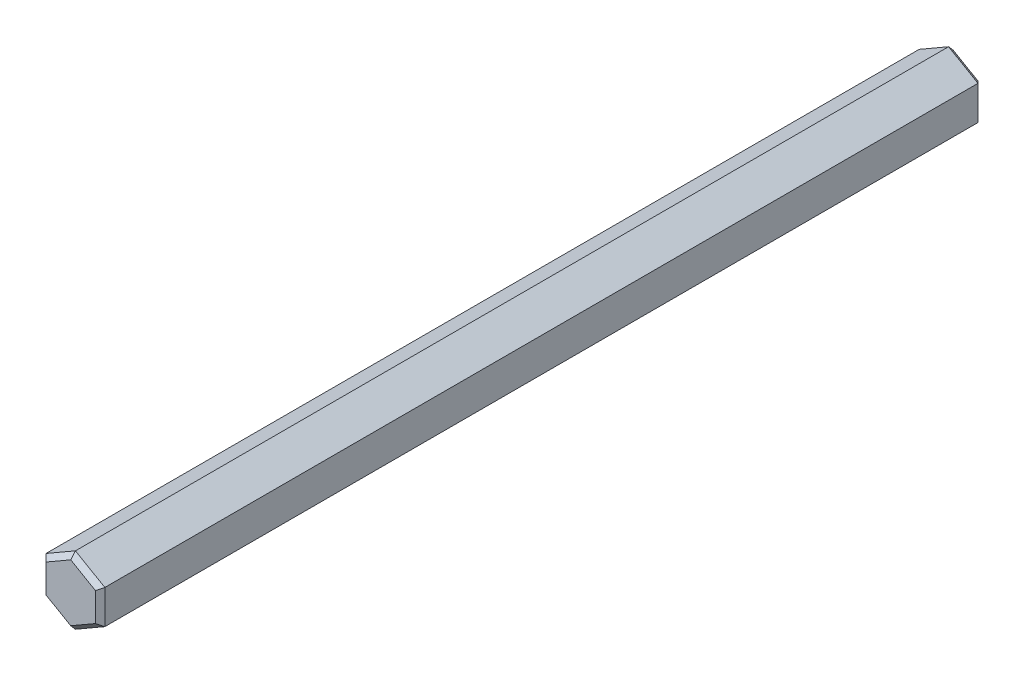
ISO-10303-21;
HEADER;
FILE_DESCRIPTION(('STEP AP214'),'2;1');
FILE_NAME('part.step','',(''),(''),'','','');
FILE_SCHEMA(('AUTOMOTIVE_DESIGN { 1 0 10303 214 1 1 1 1 }'));
ENDSEC;
DATA;
#1=APPLICATION_CONTEXT('core data for automotive mechanical design processes');
#2=APPLICATION_PROTOCOL_DEFINITION('international standard','automotive_design',2000,#1);
#3=PRODUCT_CONTEXT('',#1,'mechanical');
#4=PRODUCT('Part','Part','',(#3));
#5=PRODUCT_RELATED_PRODUCT_CATEGORY('part','',(#4));
#6=PRODUCT_DEFINITION_FORMATION('','',#4);
#7=PRODUCT_DEFINITION_CONTEXT('part definition',#1,'design');
#8=PRODUCT_DEFINITION('design','',#6,#7);
#9=PRODUCT_DEFINITION_SHAPE('','',#8);
#10=(LENGTH_UNIT() NAMED_UNIT(*) SI_UNIT(.MILLI.,.METRE.));
#11=(NAMED_UNIT(*) PLANE_ANGLE_UNIT() SI_UNIT($,.RADIAN.));
#12=(NAMED_UNIT(*) SI_UNIT($,.STERADIAN.) SOLID_ANGLE_UNIT());
#13=UNCERTAINTY_MEASURE_WITH_UNIT(LENGTH_MEASURE(1.E-05),#10,'distance_accuracy_value','');
#14=(GEOMETRIC_REPRESENTATION_CONTEXT(3) GLOBAL_UNCERTAINTY_ASSIGNED_CONTEXT((#13)) GLOBAL_UNIT_ASSIGNED_CONTEXT((#10,
#11,#12)) REPRESENTATION_CONTEXT('',''));
#15=CARTESIAN_POINT('',(0.,0.,0.));
#16=DIRECTION('',(0.,0.,1.));
#17=DIRECTION('',(1.,0.,0.));
#18=AXIS2_PLACEMENT_3D('',#15,#16,#17);
#19=CARTESIAN_POINT('',(-1.775,-1.63101451046069,0.2));
#20=DIRECTION('',(-0.353553390593274,-0.612372435695795,-0.707106781186547));
#21=DIRECTION('',(0.,-0.755928946018454,0.654653670707978));
#22=AXIS2_PLACEMENT_3D('',#19,#20,#21);
#23=PLANE('',#22);
#24=DIRECTION('',(0.866025403784439,-0.5,0.));
#25=VECTOR('',#24,1.);
#26=CARTESIAN_POINT('',(-2.5,-1.44337567297406,0.4));
#27=LINE('',#26,#25);
#28=CARTESIAN_POINT('',(-2.5,-1.44337567297406,0.4));
#29=VERTEX_POINT('',#28);
#30=CARTESIAN_POINT('',(0.,-2.88675134594813,0.4));
#31=VERTEX_POINT('',#30);
#32=EDGE_CURVE('E277',#29,#31,#27,.T.);
#33=ORIENTED_EDGE('',*,*,#32,.F.);
#34=DIRECTION('',(-0.654653670707977,-0.377964473009227,0.654653670707977));
#35=VECTOR('',#34,1.);
#36=CARTESIAN_POINT('',(-2.1,-1.21243556529821,0.));
#37=LINE('',#36,#35);
#38=CARTESIAN_POINT('',(-2.1,-1.21243556529821,0.));
#39=VERTEX_POINT('',#38);
#40=EDGE_CURVE('E10',#39,#29,#37,.T.);
#41=ORIENTED_EDGE('',*,*,#40,.F.);
#42=DIRECTION('',(0.866025403784439,-0.5,0.));
#43=VECTOR('',#42,1.);
#44=CARTESIAN_POINT('',(-2.1,-1.21243556529821,0.));
#45=LINE('',#44,#43);
#46=CARTESIAN_POINT('',(0.,-2.42487113059642,0.));
#47=VERTEX_POINT('',#46);
#48=EDGE_CURVE('E288',#39,#47,#45,.T.);
#49=ORIENTED_EDGE('',*,*,#48,.T.);
#50=DIRECTION('',(0.,0.755928946018454,-0.654653670707978));
#51=VECTOR('',#50,1.);
#52=CARTESIAN_POINT('',(0.,-2.48260615751539,0.05));
#53=LINE('',#52,#51);
#54=EDGE_CURVE('E19',#31,#47,#53,.T.);
#55=ORIENTED_EDGE('',*,*,#54,.F.);
#56=EDGE_LOOP('',(#33,#41,#49,#55));
#57=FACE_BOUND('',#56,.T.);
#58=ADVANCED_FACE('F16',(#57),#23,.T.);
#59=CARTESIAN_POINT('',(-2.3,0.721687836487032,0.2));
#60=DIRECTION('',(-0.707106781186548,0.,-0.707106781186548));
#61=DIRECTION('',(-0.707106781186548,0.,0.707106781186548));
#62=AXIS2_PLACEMENT_3D('',#59,#60,#61);
#63=PLANE('',#62);
#64=DIRECTION('',(0.,-1.,0.));
#65=VECTOR('',#64,1.);
#66=CARTESIAN_POINT('',(-2.1,0.,0.));
#67=LINE('',#66,#65);
#68=CARTESIAN_POINT('',(-2.1,1.21243556529821,0.));
#69=VERTEX_POINT('',#68);
#70=EDGE_CURVE('E278',#69,#39,#67,.T.);
#71=ORIENTED_EDGE('',*,*,#70,.T.);
#72=ORIENTED_EDGE('',*,*,#40,.T.);
#73=DIRECTION('',(0.,-1.,0.));
#74=VECTOR('',#73,1.);
#75=CARTESIAN_POINT('',(-2.5,1.44337567297406,0.4));
#76=LINE('',#75,#74);
#77=CARTESIAN_POINT('',(-2.5,1.44337567297406,0.4));
#78=VERTEX_POINT('',#77);
#79=EDGE_CURVE('E260',#78,#29,#76,.T.);
#80=ORIENTED_EDGE('',*,*,#79,.F.);
#81=DIRECTION('',(-0.654653670707977,0.377964473009227,0.654653670707978));
#82=VECTOR('',#81,1.);
#83=CARTESIAN_POINT('',(-2.1,1.21243556529821,0.));
#84=LINE('',#83,#82);
#85=EDGE_CURVE('E282',#69,#78,#84,.T.);
#86=ORIENTED_EDGE('',*,*,#85,.F.);
#87=EDGE_LOOP('',(#71,#72,#80,#86));
#88=FACE_BOUND('',#87,.T.);
#89=ADVANCED_FACE('F495',(#88),#63,.T.);
#90=CARTESIAN_POINT('',(-1.775,-1.63101451046069,74.8));
#91=DIRECTION('',(-0.353553390593274,-0.612372435695795,0.707106781186547));
#92=DIRECTION('',(-0.866025403784439,0.5,0.));
#93=AXIS2_PLACEMENT_3D('',#90,#91,#92);
#94=PLANE('',#93);
#95=DIRECTION('',(-0.866025403784439,0.5,0.));
#96=VECTOR('',#95,1.);
#97=CARTESIAN_POINT('',(-2.5,-1.44337567297406,74.6));
#98=LINE('',#97,#96);
#99=CARTESIAN_POINT('',(0.,-2.88675134594813,74.6));
#100=VERTEX_POINT('',#99);
#101=CARTESIAN_POINT('',(-2.5,-1.44337567297407,74.6));
#102=VERTEX_POINT('',#101);
#103=EDGE_CURVE('E273',#100,#102,#98,.T.);
#104=ORIENTED_EDGE('',*,*,#103,.F.);
#105=DIRECTION('',(0.,-0.755928946018454,-0.654653670707978));
#106=VECTOR('',#105,1.);
#107=CARTESIAN_POINT('',(0.,-2.48260615751539,74.95));
#108=LINE('',#107,#106);
#109=CARTESIAN_POINT('',(0.,-2.42487113059643,75.));
#110=VERTEX_POINT('',#109);
#111=EDGE_CURVE('E295',#110,#100,#108,.T.);
#112=ORIENTED_EDGE('',*,*,#111,.F.);
#113=DIRECTION('',(0.866025403784439,-0.5,0.));
#114=VECTOR('',#113,1.);
#115=CARTESIAN_POINT('',(-2.1,-1.21243556529821,75.));
#116=LINE('',#115,#114);
#117=CARTESIAN_POINT('',(-2.1,-1.21243556529822,75.));
#118=VERTEX_POINT('',#117);
#119=EDGE_CURVE('E256',#118,#110,#116,.T.);
#120=ORIENTED_EDGE('',*,*,#119,.F.);
#121=DIRECTION('',(0.654653670707977,0.377964473009229,0.654653670707977));
#122=VECTOR('',#121,1.);
#123=CARTESIAN_POINT('',(-2.5,-1.44337567297406,74.6));
#124=LINE('',#123,#122);
#125=EDGE_CURVE('E25',#102,#118,#124,.T.);
#126=ORIENTED_EDGE('',*,*,#125,.F.);
#127=EDGE_LOOP('',(#104,#112,#120,#126));
#128=FACE_BOUND('',#127,.T.);
#129=ADVANCED_FACE('F484',(#128),#94,.T.);
#130=CARTESIAN_POINT('',(-2.3,0.721687836487032,74.8));
#131=DIRECTION('',(-0.707106781186548,0.,0.707106781186547));
#132=DIRECTION('',(0.,1.,0.));
#133=AXIS2_PLACEMENT_3D('',#130,#131,#132);
#134=PLANE('',#133);
#135=DIRECTION('',(0.,1.,0.));
#136=VECTOR('',#135,1.);
#137=CARTESIAN_POINT('',(-2.5,1.44337567297406,74.6));
#138=LINE('',#137,#136);
#139=CARTESIAN_POINT('',(-2.5,1.44337567297406,74.6));
#140=VERTEX_POINT('',#139);
#141=EDGE_CURVE('E213',#102,#140,#138,.T.);
#142=ORIENTED_EDGE('',*,*,#141,.F.);
#143=ORIENTED_EDGE('',*,*,#125,.T.);
#144=DIRECTION('',(0.,-1.,0.));
#145=VECTOR('',#144,1.);
#146=CARTESIAN_POINT('',(-2.1,0.,75.));
#147=LINE('',#146,#145);
#148=CARTESIAN_POINT('',(-2.1,1.21243556529822,75.));
#149=VERTEX_POINT('',#148);
#150=EDGE_CURVE('E252',#149,#118,#147,.T.);
#151=ORIENTED_EDGE('',*,*,#150,.F.);
#152=DIRECTION('',(0.654653670707979,-0.377964473009227,0.654653670707977));
#153=VECTOR('',#152,1.);
#154=CARTESIAN_POINT('',(-2.5,1.44337567297407,74.6));
#155=LINE('',#154,#153);
#156=EDGE_CURVE('E210',#140,#149,#155,.T.);
#157=ORIENTED_EDGE('',*,*,#156,.F.);
#158=EDGE_LOOP('',(#142,#143,#151,#157));
#159=FACE_BOUND('',#158,.T.);
#160=ADVANCED_FACE('F465',(#159),#134,.T.);
#161=CARTESIAN_POINT('',(0.525,-2.35270234694772,0.2));
#162=DIRECTION('',(0.353553390593274,-0.612372435695795,-0.707106781186547));
#163=DIRECTION('',(0.,-0.755928946018454,0.654653670707978));
#164=AXIS2_PLACEMENT_3D('',#161,#162,#163);
#165=PLANE('',#164);
#166=DIRECTION('',(0.866025403784439,0.5,0.));
#167=VECTOR('',#166,1.);
#168=CARTESIAN_POINT('',(0.,-2.88675134594813,0.4));
#169=LINE('',#168,#167);
#170=CARTESIAN_POINT('',(2.5,-1.44337567297406,0.4));
#171=VERTEX_POINT('',#170);
#172=EDGE_CURVE('E230',#31,#171,#169,.T.);
#173=ORIENTED_EDGE('',*,*,#172,.F.);
#174=ORIENTED_EDGE('',*,*,#54,.T.);
#175=DIRECTION('',(0.866025403784439,0.5,0.));
#176=VECTOR('',#175,1.);
#177=CARTESIAN_POINT('',(0.,-2.42487113059642,0.));
#178=LINE('',#177,#176);
#179=CARTESIAN_POINT('',(2.1,-1.21243556529821,0.));
#180=VERTEX_POINT('',#179);
#181=EDGE_CURVE('E285',#47,#180,#178,.T.);
#182=ORIENTED_EDGE('',*,*,#181,.T.);
#183=DIRECTION('',(-0.654653670707977,0.377964473009227,-0.654653670707977));
#184=VECTOR('',#183,1.);
#185=CARTESIAN_POINT('',(2.5,-1.44337567297406,0.4));
#186=LINE('',#185,#184);
#187=EDGE_CURVE('E243',#171,#180,#186,.T.);
#188=ORIENTED_EDGE('',*,*,#187,.F.);
#189=EDGE_LOOP('',(#173,#174,#182,#188));
#190=FACE_BOUND('',#189,.T.);
#191=ADVANCED_FACE('F416',(#190),#165,.T.);
#192=CARTESIAN_POINT('',(0.525,-2.35270234694772,74.8));
#193=DIRECTION('',(0.353553390593274,-0.612372435695795,0.707106781186547));
#194=DIRECTION('',(-0.866025403784439,-0.5,0.));
#195=AXIS2_PLACEMENT_3D('',#192,#193,#194);
#196=PLANE('',#195);
#197=DIRECTION('',(0.866025403784439,0.5,0.));
#198=VECTOR('',#197,1.);
#199=CARTESIAN_POINT('',(0.,-2.42487113059643,75.));
#200=LINE('',#199,#198);
#201=CARTESIAN_POINT('',(2.1,-1.21243556529822,75.));
#202=VERTEX_POINT('',#201);
#203=EDGE_CURVE('E214',#110,#202,#200,.T.);
#204=ORIENTED_EDGE('',*,*,#203,.F.);
#205=ORIENTED_EDGE('',*,*,#111,.T.);
#206=DIRECTION('',(-0.866025403784439,-0.5,0.));
#207=VECTOR('',#206,1.);
#208=CARTESIAN_POINT('',(0.,-2.88675134594813,74.6));
#209=LINE('',#208,#207);
#210=CARTESIAN_POINT('',(2.5,-1.44337567297407,74.6));
#211=VERTEX_POINT('',#210);
#212=EDGE_CURVE('E222',#211,#100,#209,.T.);
#213=ORIENTED_EDGE('',*,*,#212,.F.);
#214=DIRECTION('',(0.654653670707977,-0.377964473009229,-0.654653670707977));
#215=VECTOR('',#214,1.);
#216=CARTESIAN_POINT('',(2.1,-1.21243556529821,75.));
#217=LINE('',#216,#215);
#218=EDGE_CURVE('E238',#202,#211,#217,.T.);
#219=ORIENTED_EDGE('',*,*,#218,.F.);
#220=EDGE_LOOP('',(#204,#205,#213,#219));
#221=FACE_BOUND('',#220,.T.);
#222=ADVANCED_FACE('F410',(#221),#196,.T.);
#223=CARTESIAN_POINT('',(-2.5,-1.44337567297406,0.));
#224=DIRECTION('',(-0.5,-0.866025403784439,0.));
#225=DIRECTION('',(-0.866025403784439,0.5,0.));
#226=AXIS2_PLACEMENT_3D('',#223,#224,#225);
#227=PLANE('',#226);
#228=ORIENTED_EDGE('',*,*,#103,.T.);
#229=DIRECTION('',(0.,0.,1.));
#230=VECTOR('',#229,1.);
#231=CARTESIAN_POINT('',(-2.5,-1.44337567297406,0.));
#232=LINE('',#231,#230);
#233=EDGE_CURVE('E264',#29,#102,#232,.T.);
#234=ORIENTED_EDGE('',*,*,#233,.F.);
#235=ORIENTED_EDGE('',*,*,#32,.T.);
#236=DIRECTION('',(0.,0.,-1.));
#237=VECTOR('',#236,1.);
#238=CARTESIAN_POINT('',(0.,-2.88675134594813,0.));
#239=LINE('',#238,#237);
#240=EDGE_CURVE('E226',#100,#31,#239,.T.);
#241=ORIENTED_EDGE('',*,*,#240,.F.);
#242=EDGE_LOOP('',(#228,#234,#235,#241));
#243=FACE_BOUND('',#242,.T.);
#244=ADVANCED_FACE('F415',(#243),#227,.T.);
#245=CARTESIAN_POINT('',(0.,0.,0.));
#246=DIRECTION('',(0.,0.,1.));
#247=DIRECTION('',(1.,0.,0.));
#248=AXIS2_PLACEMENT_3D('',#245,#246,#247);
#249=PLANE('',#248);
#250=ORIENTED_EDGE('',*,*,#181,.F.);
#251=ORIENTED_EDGE('',*,*,#48,.F.);
#252=ORIENTED_EDGE('',*,*,#70,.F.);
#253=DIRECTION('',(-0.866025403784439,-0.5,0.));
#254=VECTOR('',#253,1.);
#255=CARTESIAN_POINT('',(0.,2.42487113059643,0.));
#256=LINE('',#255,#254);
#257=CARTESIAN_POINT('',(0.,2.42487113059643,0.));
#258=VERTEX_POINT('',#257);
#259=EDGE_CURVE('E272',#258,#69,#256,.T.);
#260=ORIENTED_EDGE('',*,*,#259,.F.);
#261=DIRECTION('',(-0.866025403784439,0.5,0.));
#262=VECTOR('',#261,1.);
#263=CARTESIAN_POINT('',(2.1,1.21243556529821,0.));
#264=LINE('',#263,#262);
#265=CARTESIAN_POINT('',(2.1,1.21243556529821,0.));
#266=VERTEX_POINT('',#265);
#267=EDGE_CURVE('E150',#266,#258,#264,.T.);
#268=ORIENTED_EDGE('',*,*,#267,.F.);
#269=DIRECTION('',(0.,1.,0.));
#270=VECTOR('',#269,1.);
#271=CARTESIAN_POINT('',(2.1,-0.721687836487033,0.));
#272=LINE('',#271,#270);
#273=EDGE_CURVE('E144',#180,#266,#272,.T.);
#274=ORIENTED_EDGE('',*,*,#273,.F.);
#275=EDGE_LOOP('',(#250,#251,#252,#260,#268,#274));
#276=FACE_BOUND('',#275,.T.);
#277=ADVANCED_FACE('F329',(#276),#249,.F.);
#278=CARTESIAN_POINT('',(-0.525,2.35270234694772,0.2));
#279=DIRECTION('',(-0.353553390593274,0.612372435695795,-0.707106781186547));
#280=DIRECTION('',(-0.894427190999916,0.,0.447213595499959));
#281=AXIS2_PLACEMENT_3D('',#278,#279,#280);
#282=PLANE('',#281);
#283=ORIENTED_EDGE('',*,*,#259,.T.);
#284=ORIENTED_EDGE('',*,*,#85,.T.);
#285=DIRECTION('',(-0.866025403784439,-0.5,0.));
#286=VECTOR('',#285,1.);
#287=CARTESIAN_POINT('',(0.,2.88675134594813,0.4));
#288=LINE('',#287,#286);
#289=CARTESIAN_POINT('',(0.,2.88675134594813,0.4));
#290=VERTEX_POINT('',#289);
#291=EDGE_CURVE('E191',#290,#78,#288,.T.);
#292=ORIENTED_EDGE('',*,*,#291,.F.);
#293=DIRECTION('',(0.,0.755928946018454,0.654653670707977));
#294=VECTOR('',#293,1.);
#295=CARTESIAN_POINT('',(0.,2.07021310809423,-0.307142857142858));
#296=LINE('',#295,#294);
#297=EDGE_CURVE('E169',#258,#290,#296,.T.);
#298=ORIENTED_EDGE('',*,*,#297,.F.);
#299=EDGE_LOOP('',(#283,#284,#292,#298));
#300=FACE_BOUND('',#299,.T.);
#301=ADVANCED_FACE('F323',(#300),#282,.T.);
#302=CARTESIAN_POINT('',(-2.5,1.44337567297406,0.));
#303=DIRECTION('',(-1.,0.,0.));
#304=DIRECTION('',(0.,0.,1.));
#305=AXIS2_PLACEMENT_3D('',#302,#303,#304);
#306=PLANE('',#305);
#307=ORIENTED_EDGE('',*,*,#141,.T.);
#308=DIRECTION('',(0.,0.,1.));
#309=VECTOR('',#308,1.);
#310=CARTESIAN_POINT('',(-2.5,1.44337567297406,0.));
#311=LINE('',#310,#309);
#312=EDGE_CURVE('E151',#78,#140,#311,.T.);
#313=ORIENTED_EDGE('',*,*,#312,.F.);
#314=ORIENTED_EDGE('',*,*,#79,.T.);
#315=ORIENTED_EDGE('',*,*,#233,.T.);
#316=EDGE_LOOP('',(#307,#313,#314,#315));
#317=FACE_BOUND('',#316,.T.);
#318=ADVANCED_FACE('F328',(#317),#306,.T.);
#319=CARTESIAN_POINT('',(-0.525,2.35270234694772,74.8));
#320=DIRECTION('',(-0.353553390593274,0.612372435695795,0.707106781186547));
#321=DIRECTION('',(0.866025403784439,0.5,0.));
#322=AXIS2_PLACEMENT_3D('',#319,#320,#321);
#323=PLANE('',#322);
#324=DIRECTION('',(0.866025403784439,0.5,0.));
#325=VECTOR('',#324,1.);
#326=CARTESIAN_POINT('',(0.,2.88675134594813,74.6));
#327=LINE('',#326,#325);
#328=CARTESIAN_POINT('',(0.,2.88675134594813,74.6));
#329=VERTEX_POINT('',#328);
#330=EDGE_CURVE('E195',#140,#329,#327,.T.);
#331=ORIENTED_EDGE('',*,*,#330,.F.);
#332=ORIENTED_EDGE('',*,*,#156,.T.);
#333=DIRECTION('',(-0.866025403784439,-0.5,0.));
#334=VECTOR('',#333,1.);
#335=CARTESIAN_POINT('',(0.,2.42487113059643,75.));
#336=LINE('',#335,#334);
#337=CARTESIAN_POINT('',(0.,2.42487113059643,75.));
#338=VERTEX_POINT('',#337);
#339=EDGE_CURVE('E248',#338,#149,#336,.T.);
#340=ORIENTED_EDGE('',*,*,#339,.F.);
#341=DIRECTION('',(0.,0.755928946018454,-0.654653670707978));
#342=VECTOR('',#341,1.);
#343=CARTESIAN_POINT('',(0.,2.48260615751539,74.95));
#344=LINE('',#343,#342);
#345=EDGE_CURVE('E163',#338,#329,#344,.T.);
#346=ORIENTED_EDGE('',*,*,#345,.T.);
#347=EDGE_LOOP('',(#331,#332,#340,#346));
#348=FACE_BOUND('',#347,.T.);
#349=ADVANCED_FACE('F427',(#348),#323,.T.);
#350=CARTESIAN_POINT('',(0.,0.,75.));
#351=DIRECTION('',(0.,0.,1.));
#352=DIRECTION('',(1.,0.,0.));
#353=AXIS2_PLACEMENT_3D('',#350,#351,#352);
#354=PLANE('',#353);
#355=ORIENTED_EDGE('',*,*,#339,.T.);
#356=ORIENTED_EDGE('',*,*,#150,.T.);
#357=ORIENTED_EDGE('',*,*,#119,.T.);
#358=ORIENTED_EDGE('',*,*,#203,.T.);
#359=DIRECTION('',(0.,-1.,0.));
#360=VECTOR('',#359,1.);
#361=CARTESIAN_POINT('',(2.1,-0.721687836487033,75.));
#362=LINE('',#361,#360);
#363=CARTESIAN_POINT('',(2.1,1.21243556529821,75.));
#364=VERTEX_POINT('',#363);
#365=EDGE_CURVE('E233',#364,#202,#362,.T.);
#366=ORIENTED_EDGE('',*,*,#365,.F.);
#367=DIRECTION('',(0.866025403784439,-0.5,0.));
#368=VECTOR('',#367,1.);
#369=CARTESIAN_POINT('',(0.,2.42487113059643,75.));
#370=LINE('',#369,#368);
#371=EDGE_CURVE('E203',#338,#364,#370,.T.);
#372=ORIENTED_EDGE('',*,*,#371,.F.);
#373=EDGE_LOOP('',(#355,#356,#357,#358,#366,#372));
#374=FACE_BOUND('',#373,.T.);
#375=ADVANCED_FACE('F403',(#374),#354,.T.);
#376=CARTESIAN_POINT('',(2.3,-0.721687836487033,0.2));
#377=DIRECTION('',(0.707106781186548,0.,-0.707106781186548));
#378=DIRECTION('',(0.,-1.,0.));
#379=AXIS2_PLACEMENT_3D('',#376,#377,#378);
#380=PLANE('',#379);
#381=DIRECTION('',(0.,1.,0.));
#382=VECTOR('',#381,1.);
#383=CARTESIAN_POINT('',(2.5,-1.44337567297406,0.4));
#384=LINE('',#383,#382);
#385=CARTESIAN_POINT('',(2.5,1.44337567297406,0.4));
#386=VERTEX_POINT('',#385);
#387=EDGE_CURVE('E141',#171,#386,#384,.T.);
#388=ORIENTED_EDGE('',*,*,#387,.F.);
#389=ORIENTED_EDGE('',*,*,#187,.T.);
#390=ORIENTED_EDGE('',*,*,#273,.T.);
#391=DIRECTION('',(-0.654653670707977,-0.377964473009227,-0.654653670707977));
#392=VECTOR('',#391,1.);
#393=CARTESIAN_POINT('',(2.5,1.44337567297406,0.4));
#394=LINE('',#393,#392);
#395=EDGE_CURVE('E137',#386,#266,#394,.T.);
#396=ORIENTED_EDGE('',*,*,#395,.F.);
#397=EDGE_LOOP('',(#388,#389,#390,#396));
#398=FACE_BOUND('',#397,.T.);
#399=ADVANCED_FACE('F139',(#398),#380,.T.);
#400=CARTESIAN_POINT('',(2.3,-0.721687836487033,74.8));
#401=DIRECTION('',(0.707106781186548,0.,0.707106781186547));
#402=DIRECTION('',(0.,-1.,0.));
#403=AXIS2_PLACEMENT_3D('',#400,#401,#402);
#404=PLANE('',#403);
#405=ORIENTED_EDGE('',*,*,#365,.T.);
#406=ORIENTED_EDGE('',*,*,#218,.T.);
#407=DIRECTION('',(0.,-1.,0.));
#408=VECTOR('',#407,1.);
#409=CARTESIAN_POINT('',(2.5,-1.44337567297406,74.6));
#410=LINE('',#409,#408);
#411=CARTESIAN_POINT('',(2.5,1.44337567297406,74.6));
#412=VERTEX_POINT('',#411);
#413=EDGE_CURVE('E190',#412,#211,#410,.T.);
#414=ORIENTED_EDGE('',*,*,#413,.F.);
#415=DIRECTION('',(0.654653670707968,0.377964473009221,-0.65465367070799));
#416=VECTOR('',#415,1.);
#417=CARTESIAN_POINT('',(2.1,1.21243556529822,75.));
#418=LINE('',#417,#416);
#419=EDGE_CURVE('E207',#364,#412,#418,.T.);
#420=ORIENTED_EDGE('',*,*,#419,.F.);
#421=EDGE_LOOP('',(#405,#406,#414,#420));
#422=FACE_BOUND('',#421,.T.);
#423=ADVANCED_FACE('F351',(#422),#404,.T.);
#424=CARTESIAN_POINT('',(0.,-2.88675134594813,0.));
#425=DIRECTION('',(0.5,-0.866025403784439,0.));
#426=DIRECTION('',(0.,0.,-1.));
#427=AXIS2_PLACEMENT_3D('',#424,#425,#426);
#428=PLANE('',#427);
#429=ORIENTED_EDGE('',*,*,#212,.T.);
#430=ORIENTED_EDGE('',*,*,#240,.T.);
#431=ORIENTED_EDGE('',*,*,#172,.T.);
#432=DIRECTION('',(0.,0.,-1.));
#433=VECTOR('',#432,1.);
#434=CARTESIAN_POINT('',(2.5,-1.44337567297406,0.));
#435=LINE('',#434,#433);
#436=EDGE_CURVE('E161',#211,#171,#435,.T.);
#437=ORIENTED_EDGE('',*,*,#436,.F.);
#438=EDGE_LOOP('',(#429,#430,#431,#437));
#439=FACE_BOUND('',#438,.T.);
#440=ADVANCED_FACE('F343',(#439),#428,.T.);
#441=CARTESIAN_POINT('',(1.775,1.63101451046069,0.2));
#442=DIRECTION('',(0.353553390593274,0.612372435695795,-0.707106781186548));
#443=DIRECTION('',(-0.894427190999916,0.,-0.447213595499959));
#444=AXIS2_PLACEMENT_3D('',#441,#442,#443);
#445=PLANE('',#444);
#446=DIRECTION('',(-0.866025403784439,0.5,0.));
#447=VECTOR('',#446,1.);
#448=CARTESIAN_POINT('',(2.5,1.44337567297406,0.4));
#449=LINE('',#448,#447);
#450=EDGE_CURVE('E166',#386,#290,#449,.T.);
#451=ORIENTED_EDGE('',*,*,#450,.F.);
#452=ORIENTED_EDGE('',*,*,#395,.T.);
#453=ORIENTED_EDGE('',*,*,#267,.T.);
#454=ORIENTED_EDGE('',*,*,#297,.T.);
#455=EDGE_LOOP('',(#451,#452,#453,#454));
#456=FACE_BOUND('',#455,.T.);
#457=ADVANCED_FACE('F167',(#456),#445,.T.);
#458=CARTESIAN_POINT('',(0.,2.88675134594813,0.));
#459=DIRECTION('',(-0.5,0.866025403784439,0.));
#460=DIRECTION('',(0.,0.,1.));
#461=AXIS2_PLACEMENT_3D('',#458,#459,#460);
#462=PLANE('',#461);
#463=ORIENTED_EDGE('',*,*,#330,.T.);
#464=DIRECTION('',(0.,0.,1.));
#465=VECTOR('',#464,1.);
#466=CARTESIAN_POINT('',(0.,2.88675134594813,0.));
#467=LINE('',#466,#465);
#468=EDGE_CURVE('E174',#290,#329,#467,.T.);
#469=ORIENTED_EDGE('',*,*,#468,.F.);
#470=ORIENTED_EDGE('',*,*,#291,.T.);
#471=ORIENTED_EDGE('',*,*,#312,.T.);
#472=EDGE_LOOP('',(#463,#469,#470,#471));
#473=FACE_BOUND('',#472,.T.);
#474=ADVANCED_FACE('F342',(#473),#462,.T.);
#475=CARTESIAN_POINT('',(1.775,1.63101451046069,74.8));
#476=DIRECTION('',(0.353553390593274,0.612372435695795,0.707106781186547));
#477=DIRECTION('',(0.866025403784439,-0.5,0.));
#478=AXIS2_PLACEMENT_3D('',#475,#476,#477);
#479=PLANE('',#478);
#480=DIRECTION('',(0.866025403784439,-0.5,0.));
#481=VECTOR('',#480,1.);
#482=CARTESIAN_POINT('',(2.5,1.44337567297406,74.6));
#483=LINE('',#482,#481);
#484=EDGE_CURVE('E178',#329,#412,#483,.T.);
#485=ORIENTED_EDGE('',*,*,#484,.F.);
#486=ORIENTED_EDGE('',*,*,#345,.F.);
#487=ORIENTED_EDGE('',*,*,#371,.T.);
#488=ORIENTED_EDGE('',*,*,#419,.T.);
#489=EDGE_LOOP('',(#485,#486,#487,#488));
#490=FACE_BOUND('',#489,.T.);
#491=ADVANCED_FACE('F366',(#490),#479,.T.);
#492=CARTESIAN_POINT('',(2.5,-1.44337567297406,0.));
#493=DIRECTION('',(1.,0.,0.));
#494=DIRECTION('',(0.,1.,0.));
#495=AXIS2_PLACEMENT_3D('',#492,#493,#494);
#496=PLANE('',#495);
#497=ORIENTED_EDGE('',*,*,#413,.T.);
#498=ORIENTED_EDGE('',*,*,#436,.T.);
#499=ORIENTED_EDGE('',*,*,#387,.T.);
#500=DIRECTION('',(0.,0.,-1.));
#501=VECTOR('',#500,1.);
#502=CARTESIAN_POINT('',(2.5,1.44337567297406,0.));
#503=LINE('',#502,#501);
#504=EDGE_CURVE('E158',#412,#386,#503,.T.);
#505=ORIENTED_EDGE('',*,*,#504,.F.);
#506=EDGE_LOOP('',(#497,#498,#499,#505));
#507=FACE_BOUND('',#506,.T.);
#508=ADVANCED_FACE('F156',(#507),#496,.T.);
#509=CARTESIAN_POINT('',(2.5,1.44337567297406,0.));
#510=DIRECTION('',(0.5,0.866025403784439,0.));
#511=DIRECTION('',(0.,0.,-1.));
#512=AXIS2_PLACEMENT_3D('',#509,#510,#511);
#513=PLANE('',#512);
#514=ORIENTED_EDGE('',*,*,#484,.T.);
#515=ORIENTED_EDGE('',*,*,#504,.T.);
#516=ORIENTED_EDGE('',*,*,#450,.T.);
#517=ORIENTED_EDGE('',*,*,#468,.T.);
#518=EDGE_LOOP('',(#514,#515,#516,#517));
#519=FACE_BOUND('',#518,.T.);
#520=ADVANCED_FACE('F176',(#519),#513,.T.);
#521=CLOSED_SHELL('',(#58,#89,#129,#160,#191,#222,#244,#277,#301,#318,#349,#375,#399,#423,#440,
#457,#474,#491,#508,#520));
#522=MANIFOLD_SOLID_BREP('B1',#521);
#523=ADVANCED_BREP_SHAPE_REPRESENTATION('',(#18,#522),#14);
#524=SHAPE_DEFINITION_REPRESENTATION(#9,#523);
ENDSEC;
END-ISO-10303-21;
